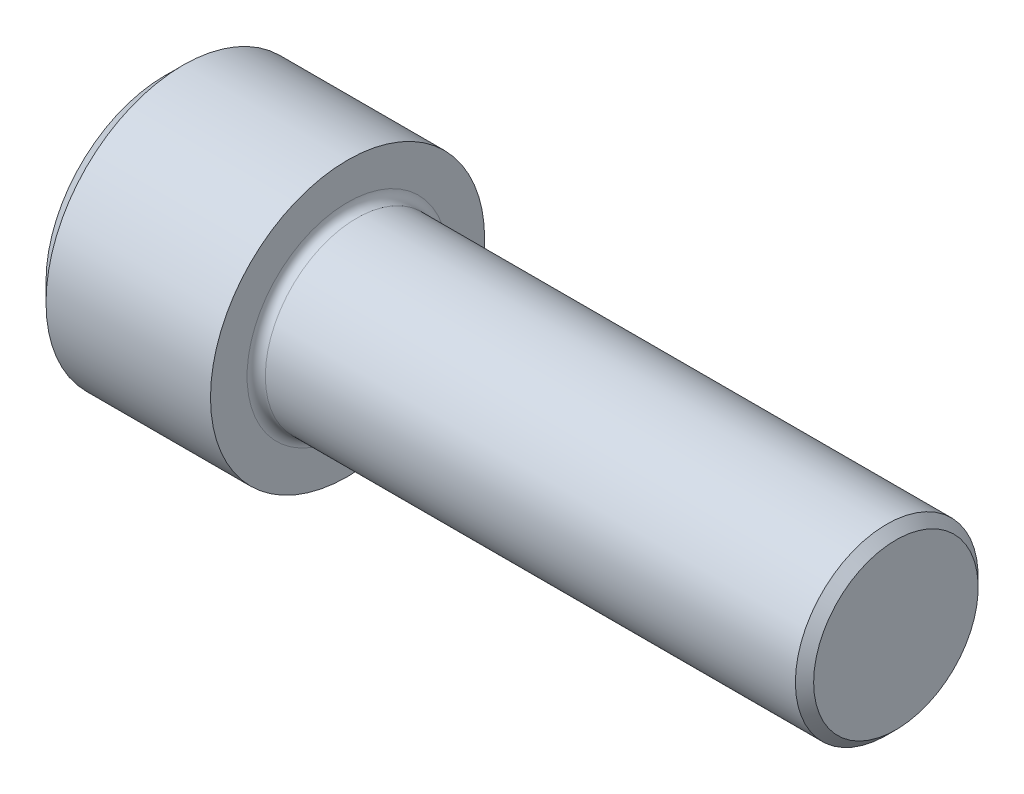
ISO-10303-21;
HEADER;
FILE_DESCRIPTION(('STEP AP214'),'2;1');
FILE_NAME('part.step','',(''),(''),'','','');
FILE_SCHEMA(('AUTOMOTIVE_DESIGN { 1 0 10303 214 1 1 1 1 }'));
ENDSEC;
DATA;
#1=APPLICATION_CONTEXT('core data for automotive mechanical design processes');
#2=APPLICATION_PROTOCOL_DEFINITION('international standard','automotive_design',2000,#1);
#3=PRODUCT_CONTEXT('',#1,'mechanical');
#4=PRODUCT('Part','Part','',(#3));
#5=PRODUCT_RELATED_PRODUCT_CATEGORY('part','',(#4));
#6=PRODUCT_DEFINITION_FORMATION('','',#4);
#7=PRODUCT_DEFINITION_CONTEXT('part definition',#1,'design');
#8=PRODUCT_DEFINITION('design','',#6,#7);
#9=PRODUCT_DEFINITION_SHAPE('','',#8);
#10=(LENGTH_UNIT() NAMED_UNIT(*) SI_UNIT(.MILLI.,.METRE.));
#11=(NAMED_UNIT(*) PLANE_ANGLE_UNIT() SI_UNIT($,.RADIAN.));
#12=(NAMED_UNIT(*) SI_UNIT($,.STERADIAN.) SOLID_ANGLE_UNIT());
#13=UNCERTAINTY_MEASURE_WITH_UNIT(LENGTH_MEASURE(1.E-05),#10,'distance_accuracy_value','');
#14=(GEOMETRIC_REPRESENTATION_CONTEXT(3) GLOBAL_UNCERTAINTY_ASSIGNED_CONTEXT((#13)) GLOBAL_UNIT_ASSIGNED_CONTEXT((#10,
#11,#12)) REPRESENTATION_CONTEXT('',''));
#15=CARTESIAN_POINT('',(0.,0.,0.));
#16=DIRECTION('',(0.,0.,1.));
#17=DIRECTION('',(1.,0.,0.));
#18=AXIS2_PLACEMENT_3D('',#15,#16,#17);
#19=CARTESIAN_POINT('',(0.,0.,0.));
#20=DIRECTION('',(-1.,0.,0.));
#21=DIRECTION('',(0.,0.,1.));
#22=AXIS2_PLACEMENT_3D('',#19,#20,#21);
#23=PLANE('',#22);
#24=DIRECTION('',(0.,-0.499999999999999,0.866025403784439));
#25=VECTOR('',#24,1.);
#26=CARTESIAN_POINT('',(0.,10.9985226280624,0.));
#27=LINE('',#26,#25);
#28=CARTESIAN_POINT('',(0.,10.9985226280624,0.));
#29=VERTEX_POINT('',#28);
#30=CARTESIAN_POINT('',(0.,5.4992613140312,9.52499999999999));
#31=VERTEX_POINT('',#30);
#32=EDGE_CURVE('E257',#29,#31,#27,.T.);
#33=ORIENTED_EDGE('',*,*,#32,.T.);
#34=DIRECTION('',(0.,1.,0.));
#35=VECTOR('',#34,1.);
#36=CARTESIAN_POINT('',(0.,-5.49926131403117,9.52500000000001));
#37=LINE('',#36,#35);
#38=CARTESIAN_POINT('',(0.,-5.49926131403117,9.52500000000001));
#39=VERTEX_POINT('',#38);
#40=EDGE_CURVE('E128',#39,#31,#37,.T.);
#41=ORIENTED_EDGE('',*,*,#40,.F.);
#42=DIRECTION('',(0.,-0.500000000000001,-0.866025403784438));
#43=VECTOR('',#42,1.);
#44=CARTESIAN_POINT('',(0.,-5.49926131403117,9.52500000000001));
#45=LINE('',#44,#43);
#46=CARTESIAN_POINT('',(0.,-10.9985226280624,0.));
#47=VERTEX_POINT('',#46);
#48=EDGE_CURVE('E260',#39,#47,#45,.T.);
#49=ORIENTED_EDGE('',*,*,#48,.T.);
#50=DIRECTION('',(0.,0.499999999999998,-0.86602540378444));
#51=VECTOR('',#50,1.);
#52=CARTESIAN_POINT('',(0.,-10.9985226280624,0.));
#53=LINE('',#52,#51);
#54=CARTESIAN_POINT('',(0.,-5.4992613140312,-9.525));
#55=VERTEX_POINT('',#54);
#56=EDGE_CURVE('E263',#47,#55,#53,.T.);
#57=ORIENTED_EDGE('',*,*,#56,.T.);
#58=DIRECTION('',(0.,-1.,0.));
#59=VECTOR('',#58,1.);
#60=CARTESIAN_POINT('',(0.,5.49926131403117,-9.52500000000001));
#61=LINE('',#60,#59);
#62=CARTESIAN_POINT('',(0.,5.49926131403117,-9.52500000000001));
#63=VERTEX_POINT('',#62);
#64=EDGE_CURVE('E266',#63,#55,#61,.T.);
#65=ORIENTED_EDGE('',*,*,#64,.F.);
#66=DIRECTION('',(0.,-0.500000000000001,-0.866025403784438));
#67=VECTOR('',#66,1.);
#68=CARTESIAN_POINT('',(0.,10.9985226280624,0.));
#69=LINE('',#68,#67);
#70=EDGE_CURVE('E123',#29,#63,#69,.T.);
#71=ORIENTED_EDGE('',*,*,#70,.F.);
#72=EDGE_LOOP('',(#33,#41,#49,#57,#65,#71));
#73=FACE_BOUND('',#72,.T.);
#74=CARTESIAN_POINT('',(0.,0.,0.));
#75=DIRECTION('',(-1.,0.,0.));
#76=DIRECTION('',(0.,0.,1.));
#77=AXIS2_PLACEMENT_3D('',#74,#75,#76);
#78=CIRCLE('',#77,16.51);
#79=CARTESIAN_POINT('',(0.,0.,16.51));
#80=VERTEX_POINT('',#79);
#81=EDGE_CURVE('E152',#80,#80,#78,.T.);
#82=ORIENTED_EDGE('',*,*,#81,.T.);
#83=EDGE_LOOP('',(#82));
#84=FACE_BOUND('',#83,.T.);
#85=ADVANCED_FACE('F32',(#73,#84),#23,.T.);
#86=CARTESIAN_POINT('',(0.,0.,0.));
#87=DIRECTION('',(1.,0.,0.));
#88=DIRECTION('',(0.,0.,-1.));
#89=AXIS2_PLACEMENT_3D('',#86,#87,#88);
#90=CONICAL_SURFACE('',#89,16.51,0.785398163397448);
#91=CARTESIAN_POINT('',(2.53999999999996,0.,0.));
#92=DIRECTION('',(-1.,0.,0.));
#93=DIRECTION('',(0.,0.,1.));
#94=AXIS2_PLACEMENT_3D('',#91,#92,#93);
#95=CIRCLE('',#94,19.05);
#96=CARTESIAN_POINT('',(2.53999999999996,0.,19.05));
#97=VERTEX_POINT('',#96);
#98=EDGE_CURVE('E149',#97,#97,#95,.T.);
#99=ORIENTED_EDGE('',*,*,#98,.T.);
#100=EDGE_LOOP('',(#99));
#101=FACE_BOUND('',#100,.T.);
#102=ORIENTED_EDGE('',*,*,#81,.F.);
#103=EDGE_LOOP('',(#102));
#104=FACE_BOUND('',#103,.T.);
#105=ADVANCED_FACE('F173',(#101,#104),#90,.T.);
#106=CARTESIAN_POINT('',(-31.75,0.,0.));
#107=DIRECTION('',(-1.,0.,0.));
#108=DIRECTION('',(0.,0.,1.));
#109=AXIS2_PLACEMENT_3D('',#106,#107,#108);
#110=CYLINDRICAL_SURFACE('',#109,19.05);
#111=CARTESIAN_POINT('',(25.4,0.,0.));
#112=DIRECTION('',(-1.,0.,0.));
#113=DIRECTION('',(0.,0.,1.));
#114=AXIS2_PLACEMENT_3D('',#111,#112,#113);
#115=CIRCLE('',#114,19.05);
#116=CARTESIAN_POINT('',(25.4,0.,19.05));
#117=VERTEX_POINT('',#116);
#118=EDGE_CURVE('E146',#117,#117,#115,.T.);
#119=ORIENTED_EDGE('',*,*,#118,.T.);
#120=EDGE_LOOP('',(#119));
#121=FACE_BOUND('',#120,.T.);
#122=ORIENTED_EDGE('',*,*,#98,.F.);
#123=EDGE_LOOP('',(#122));
#124=FACE_BOUND('',#123,.T.);
#125=ADVANCED_FACE('F178',(#121,#124),#110,.T.);
#126=CARTESIAN_POINT('',(25.4,19.05,0.));
#127=DIRECTION('',(1.,0.,0.));
#128=DIRECTION('',(0.,0.,-1.));
#129=AXIS2_PLACEMENT_3D('',#126,#127,#128);
#130=PLANE('',#129);
#131=CARTESIAN_POINT('',(25.4,0.,0.));
#132=DIRECTION('',(1.,0.,0.));
#133=DIRECTION('',(0.,0.,-1.));
#134=AXIS2_PLACEMENT_3D('',#131,#132,#133);
#135=CIRCLE('',#134,13.97);
#136=CARTESIAN_POINT('',(25.4,0.,-13.97));
#137=VERTEX_POINT('',#136);
#138=EDGE_CURVE('E40',#137,#137,#135,.F.);
#139=ORIENTED_EDGE('',*,*,#138,.T.);
#140=EDGE_LOOP('',(#139));
#141=FACE_BOUND('',#140,.T.);
#142=ORIENTED_EDGE('',*,*,#118,.F.);
#143=EDGE_LOOP('',(#142));
#144=FACE_BOUND('',#143,.T.);
#145=ADVANCED_FACE('F157',(#141,#144),#130,.T.);
#146=CARTESIAN_POINT('',(-31.75,0.,0.));
#147=DIRECTION('',(-1.,0.,0.));
#148=DIRECTION('',(0.,0.,1.));
#149=AXIS2_PLACEMENT_3D('',#146,#147,#148);
#150=CYLINDRICAL_SURFACE('',#149,12.7);
#151=CARTESIAN_POINT('',(26.67,0.,0.));
#152=DIRECTION('',(1.,0.,0.));
#153=DIRECTION('',(0.,0.,-1.));
#154=AXIS2_PLACEMENT_3D('',#151,#152,#153);
#155=CIRCLE('',#154,12.7);
#156=CARTESIAN_POINT('',(26.67,0.,-12.7));
#157=VERTEX_POINT('',#156);
#158=EDGE_CURVE('E11',#157,#157,#155,.T.);
#159=ORIENTED_EDGE('',*,*,#158,.T.);
#160=EDGE_LOOP('',(#159));
#161=FACE_BOUND('',#160,.T.);
#162=CARTESIAN_POINT('',(100.33127,0.,0.));
#163=DIRECTION('',(-1.,0.,0.));
#164=DIRECTION('',(0.,0.,1.));
#165=AXIS2_PLACEMENT_3D('',#162,#163,#164);
#166=CIRCLE('',#165,12.7);
#167=CARTESIAN_POINT('',(100.33127,0.,12.7));
#168=VERTEX_POINT('',#167);
#169=EDGE_CURVE('E143',#168,#168,#166,.T.);
#170=ORIENTED_EDGE('',*,*,#169,.T.);
#171=EDGE_LOOP('',(#170));
#172=FACE_BOUND('',#171,.T.);
#173=ADVANCED_FACE('F188',(#161,#172),#150,.T.);
#174=CARTESIAN_POINT('',(101.6,0.,0.));
#175=DIRECTION('',(-1.,0.,0.));
#176=DIRECTION('',(0.,0.,1.));
#177=AXIS2_PLACEMENT_3D('',#174,#175,#176);
#178=CONICAL_SURFACE('',#177,11.43127,0.785398163397472);
#179=ORIENTED_EDGE('',*,*,#169,.F.);
#180=EDGE_LOOP('',(#179));
#181=FACE_BOUND('',#180,.T.);
#182=CARTESIAN_POINT('',(101.6,0.,0.));
#183=DIRECTION('',(-1.,0.,0.));
#184=DIRECTION('',(0.,0.,1.));
#185=AXIS2_PLACEMENT_3D('',#182,#183,#184);
#186=CIRCLE('',#185,11.43127);
#187=CARTESIAN_POINT('',(101.6,0.,11.43127));
#188=VERTEX_POINT('',#187);
#189=EDGE_CURVE('E139',#188,#188,#186,.T.);
#190=ORIENTED_EDGE('',*,*,#189,.T.);
#191=EDGE_LOOP('',(#190));
#192=FACE_BOUND('',#191,.T.);
#193=ADVANCED_FACE('F168',(#181,#192),#178,.T.);
#194=CARTESIAN_POINT('',(101.6,11.43127,0.));
#195=DIRECTION('',(1.,0.,0.));
#196=DIRECTION('',(0.,0.,-1.));
#197=AXIS2_PLACEMENT_3D('',#194,#195,#196);
#198=PLANE('',#197);
#199=ORIENTED_EDGE('',*,*,#189,.F.);
#200=EDGE_LOOP('',(#199));
#201=FACE_BOUND('',#200,.T.);
#202=ADVANCED_FACE('F161',(#201),#198,.T.);
#203=CARTESIAN_POINT('',(26.67,0.,0.));
#204=DIRECTION('',(1.,0.,0.));
#205=DIRECTION('',(0.,0.,-1.));
#206=AXIS2_PLACEMENT_3D('',#203,#204,#205);
#207=TOROIDAL_SURFACE('',#206,13.97,1.27);
#208=ORIENTED_EDGE('',*,*,#158,.F.);
#209=EDGE_LOOP('',(#208));
#210=FACE_BOUND('',#209,.T.);
#211=ORIENTED_EDGE('',*,*,#138,.F.);
#212=EDGE_LOOP('',(#211));
#213=FACE_BOUND('',#212,.T.);
#214=ADVANCED_FACE('F34',(#210,#213),#207,.F.);
#215=CARTESIAN_POINT('',(12.573,10.9985226280624,0.));
#216=DIRECTION('',(0.,-0.86602540378444,-0.499999999999999));
#217=DIRECTION('',(0.,0.499999999999999,-0.866025403784439));
#218=AXIS2_PLACEMENT_3D('',#215,#216,#217);
#219=PLANE('',#218);
#220=ORIENTED_EDGE('',*,*,#32,.F.);
#221=DIRECTION('',(-1.,0.,0.));
#222=VECTOR('',#221,1.);
#223=CARTESIAN_POINT('',(12.573,10.9985226280624,0.));
#224=LINE('',#223,#222);
#225=CARTESIAN_POINT('',(12.573,10.9985226280624,0.));
#226=VERTEX_POINT('',#225);
#227=EDGE_CURVE('E247',#226,#29,#224,.T.);
#228=ORIENTED_EDGE('',*,*,#227,.F.);
#229=DIRECTION('',(0.,-0.499999999999999,0.866025403784439));
#230=VECTOR('',#229,1.);
#231=CARTESIAN_POINT('',(12.573,10.9985226280624,0.));
#232=LINE('',#231,#230);
#233=CARTESIAN_POINT('',(12.573,8.24889197104679,4.76249999999999));
#234=VERTEX_POINT('',#233);
#235=EDGE_CURVE('E115',#226,#234,#232,.T.);
#236=ORIENTED_EDGE('',*,*,#235,.T.);
#237=CARTESIAN_POINT('',(12.573,5.4992613140312,9.52499999999999));
#238=VERTEX_POINT('',#237);
#239=EDGE_CURVE('E106',#234,#238,#232,.T.);
#240=ORIENTED_EDGE('',*,*,#239,.T.);
#241=DIRECTION('',(-1.,0.,0.));
#242=VECTOR('',#241,1.);
#243=CARTESIAN_POINT('',(12.573,5.4992613140312,9.52499999999999));
#244=LINE('',#243,#242);
#245=EDGE_CURVE('E120',#238,#31,#244,.T.);
#246=ORIENTED_EDGE('',*,*,#245,.T.);
#247=EDGE_LOOP('',(#220,#228,#236,#240,#246));
#248=FACE_BOUND('',#247,.T.);
#249=ADVANCED_FACE('F119',(#248),#219,.T.);
#250=CARTESIAN_POINT('',(12.573,-5.49926131403117,9.52500000000001));
#251=DIRECTION('',(0.,0.,1.));
#252=DIRECTION('',(0.,-1.,0.));
#253=AXIS2_PLACEMENT_3D('',#250,#251,#252);
#254=PLANE('',#253);
#255=ORIENTED_EDGE('',*,*,#40,.T.);
#256=ORIENTED_EDGE('',*,*,#245,.F.);
#257=DIRECTION('',(0.,1.,0.));
#258=VECTOR('',#257,1.);
#259=CARTESIAN_POINT('',(12.573,-5.49926131403117,9.52500000000001));
#260=LINE('',#259,#258);
#261=CARTESIAN_POINT('',(12.573,0.,9.525));
#262=VERTEX_POINT('',#261);
#263=EDGE_CURVE('E103',#262,#238,#260,.T.);
#264=ORIENTED_EDGE('',*,*,#263,.F.);
#265=CARTESIAN_POINT('',(12.573,-5.49926131403117,9.52500000000001));
#266=VERTEX_POINT('',#265);
#267=EDGE_CURVE('E114',#266,#262,#260,.T.);
#268=ORIENTED_EDGE('',*,*,#267,.F.);
#269=DIRECTION('',(-1.,0.,0.));
#270=VECTOR('',#269,1.);
#271=CARTESIAN_POINT('',(12.573,-5.49926131403117,9.52500000000001));
#272=LINE('',#271,#270);
#273=EDGE_CURVE('E130',#266,#39,#272,.T.);
#274=ORIENTED_EDGE('',*,*,#273,.T.);
#275=EDGE_LOOP('',(#255,#256,#264,#268,#274));
#276=FACE_BOUND('',#275,.T.);
#277=ADVANCED_FACE('F125',(#276),#254,.F.);
#278=CARTESIAN_POINT('',(12.573,-5.49926131403117,9.52500000000001));
#279=DIRECTION('',(0.,0.866025403784438,-0.500000000000001));
#280=DIRECTION('',(0.,0.500000000000001,0.866025403784438));
#281=AXIS2_PLACEMENT_3D('',#278,#279,#280);
#282=PLANE('',#281);
#283=ORIENTED_EDGE('',*,*,#48,.F.);
#284=ORIENTED_EDGE('',*,*,#273,.F.);
#285=DIRECTION('',(0.,-0.500000000000001,-0.866025403784438));
#286=VECTOR('',#285,1.);
#287=CARTESIAN_POINT('',(12.573,-5.49926131403117,9.52500000000001));
#288=LINE('',#287,#286);
#289=CARTESIAN_POINT('',(12.573,-8.24889197104677,4.76250000000001));
#290=VERTEX_POINT('',#289);
#291=EDGE_CURVE('E286',#266,#290,#288,.T.);
#292=ORIENTED_EDGE('',*,*,#291,.T.);
#293=CARTESIAN_POINT('',(12.573,-10.9985226280624,0.));
#294=VERTEX_POINT('',#293);
#295=EDGE_CURVE('E275',#290,#294,#288,.T.);
#296=ORIENTED_EDGE('',*,*,#295,.T.);
#297=DIRECTION('',(-1.,0.,0.));
#298=VECTOR('',#297,1.);
#299=CARTESIAN_POINT('',(12.573,-10.9985226280624,0.));
#300=LINE('',#299,#298);
#301=EDGE_CURVE('E135',#294,#47,#300,.T.);
#302=ORIENTED_EDGE('',*,*,#301,.T.);
#303=EDGE_LOOP('',(#283,#284,#292,#296,#302));
#304=FACE_BOUND('',#303,.T.);
#305=ADVANCED_FACE('F201',(#304),#282,.T.);
#306=CARTESIAN_POINT('',(12.573,-10.9985226280624,0.));
#307=DIRECTION('',(0.,0.86602540378444,0.499999999999998));
#308=DIRECTION('',(0.,-0.499999999999998,0.86602540378444));
#309=AXIS2_PLACEMENT_3D('',#306,#307,#308);
#310=PLANE('',#309);
#311=ORIENTED_EDGE('',*,*,#56,.F.);
#312=ORIENTED_EDGE('',*,*,#301,.F.);
#313=DIRECTION('',(0.,0.499999999999998,-0.86602540378444));
#314=VECTOR('',#313,1.);
#315=CARTESIAN_POINT('',(12.573,-10.9985226280624,0.));
#316=LINE('',#315,#314);
#317=CARTESIAN_POINT('',(12.573,-8.24889197104679,-4.76249999999998));
#318=VERTEX_POINT('',#317);
#319=EDGE_CURVE('E253',#294,#318,#316,.T.);
#320=ORIENTED_EDGE('',*,*,#319,.T.);
#321=CARTESIAN_POINT('',(12.573,-5.4992613140312,-9.525));
#322=VERTEX_POINT('',#321);
#323=EDGE_CURVE('E285',#318,#322,#316,.T.);
#324=ORIENTED_EDGE('',*,*,#323,.T.);
#325=DIRECTION('',(-1.,0.,0.));
#326=VECTOR('',#325,1.);
#327=CARTESIAN_POINT('',(12.573,-5.4992613140312,-9.525));
#328=LINE('',#327,#326);
#329=EDGE_CURVE('E246',#322,#55,#328,.T.);
#330=ORIENTED_EDGE('',*,*,#329,.T.);
#331=EDGE_LOOP('',(#311,#312,#320,#324,#330));
#332=FACE_BOUND('',#331,.T.);
#333=ADVANCED_FACE('F204',(#332),#310,.T.);
#334=CARTESIAN_POINT('',(12.573,5.49926131403117,-9.52500000000001));
#335=DIRECTION('',(0.,0.,-1.));
#336=DIRECTION('',(0.,1.,0.));
#337=AXIS2_PLACEMENT_3D('',#334,#335,#336);
#338=PLANE('',#337);
#339=ORIENTED_EDGE('',*,*,#64,.T.);
#340=ORIENTED_EDGE('',*,*,#329,.F.);
#341=DIRECTION('',(0.,-1.,0.));
#342=VECTOR('',#341,1.);
#343=CARTESIAN_POINT('',(12.573,5.49926131403117,-9.52500000000001));
#344=LINE('',#343,#342);
#345=CARTESIAN_POINT('',(12.573,0.,-9.525));
#346=VERTEX_POINT('',#345);
#347=EDGE_CURVE('E250',#346,#322,#344,.T.);
#348=ORIENTED_EDGE('',*,*,#347,.F.);
#349=CARTESIAN_POINT('',(12.573,5.49926131403117,-9.52500000000001));
#350=VERTEX_POINT('',#349);
#351=EDGE_CURVE('E47',#350,#346,#344,.T.);
#352=ORIENTED_EDGE('',*,*,#351,.F.);
#353=DIRECTION('',(-1.,0.,0.));
#354=VECTOR('',#353,1.);
#355=CARTESIAN_POINT('',(12.573,5.49926131403117,-9.52500000000001));
#356=LINE('',#355,#354);
#357=EDGE_CURVE('E243',#350,#63,#356,.T.);
#358=ORIENTED_EDGE('',*,*,#357,.T.);
#359=EDGE_LOOP('',(#339,#340,#348,#352,#358));
#360=FACE_BOUND('',#359,.T.);
#361=ADVANCED_FACE('F208',(#360),#338,.F.);
#362=CARTESIAN_POINT('',(12.573,10.9985226280624,0.));
#363=DIRECTION('',(0.,0.866025403784438,-0.500000000000001));
#364=DIRECTION('',(0.,0.500000000000001,0.866025403784438));
#365=AXIS2_PLACEMENT_3D('',#362,#363,#364);
#366=PLANE('',#365);
#367=ORIENTED_EDGE('',*,*,#70,.T.);
#368=ORIENTED_EDGE('',*,*,#357,.F.);
#369=DIRECTION('',(0.,-0.500000000000001,-0.866025403784438));
#370=VECTOR('',#369,1.);
#371=CARTESIAN_POINT('',(12.573,10.9985226280624,0.));
#372=LINE('',#371,#370);
#373=CARTESIAN_POINT('',(12.573,8.24889197104678,-4.76250000000002));
#374=VERTEX_POINT('',#373);
#375=EDGE_CURVE('E233',#374,#350,#372,.T.);
#376=ORIENTED_EDGE('',*,*,#375,.F.);
#377=EDGE_CURVE('E239',#226,#374,#372,.T.);
#378=ORIENTED_EDGE('',*,*,#377,.F.);
#379=ORIENTED_EDGE('',*,*,#227,.T.);
#380=EDGE_LOOP('',(#367,#368,#376,#378,#379));
#381=FACE_BOUND('',#380,.T.);
#382=ADVANCED_FACE('F212',(#381),#366,.F.);
#383=CARTESIAN_POINT('',(12.573,16.4977839420935,-9.52500000000002));
#384=DIRECTION('',(1.,0.,0.));
#385=DIRECTION('',(0.,0.,-1.));
#386=AXIS2_PLACEMENT_3D('',#383,#384,#385);
#387=PLANE('',#386);
#388=ORIENTED_EDGE('',*,*,#347,.T.);
#389=ORIENTED_EDGE('',*,*,#323,.F.);
#390=CARTESIAN_POINT('',(12.573,0.,0.));
#391=DIRECTION('',(-1.,0.,0.));
#392=DIRECTION('',(0.,0.,1.));
#393=AXIS2_PLACEMENT_3D('',#390,#391,#392);
#394=CIRCLE('',#393,9.525);
#395=EDGE_CURVE('E281',#346,#318,#394,.T.);
#396=ORIENTED_EDGE('',*,*,#395,.F.);
#397=EDGE_LOOP('',(#388,#389,#396));
#398=FACE_BOUND('',#397,.T.);
#399=ADVANCED_FACE('F216',(#398),#387,.F.);
#400=ORIENTED_EDGE('',*,*,#319,.F.);
#401=ORIENTED_EDGE('',*,*,#295,.F.);
#402=EDGE_CURVE('E133',#318,#290,#394,.T.);
#403=ORIENTED_EDGE('',*,*,#402,.F.);
#404=EDGE_LOOP('',(#400,#401,#403));
#405=FACE_BOUND('',#404,.T.);
#406=ADVANCED_FACE('F219',(#405),#387,.F.);
#407=ORIENTED_EDGE('',*,*,#291,.F.);
#408=ORIENTED_EDGE('',*,*,#267,.T.);
#409=EDGE_CURVE('E129',#290,#262,#394,.T.);
#410=ORIENTED_EDGE('',*,*,#409,.F.);
#411=EDGE_LOOP('',(#407,#408,#410));
#412=FACE_BOUND('',#411,.T.);
#413=ADVANCED_FACE('F224',(#412),#387,.F.);
#414=ORIENTED_EDGE('',*,*,#263,.T.);
#415=ORIENTED_EDGE('',*,*,#239,.F.);
#416=EDGE_CURVE('E109',#262,#234,#394,.T.);
#417=ORIENTED_EDGE('',*,*,#416,.F.);
#418=EDGE_LOOP('',(#414,#415,#417));
#419=FACE_BOUND('',#418,.T.);
#420=ADVANCED_FACE('F105',(#419),#387,.F.);
#421=ORIENTED_EDGE('',*,*,#235,.F.);
#422=ORIENTED_EDGE('',*,*,#377,.T.);
#423=EDGE_CURVE('E140',#234,#374,#394,.T.);
#424=ORIENTED_EDGE('',*,*,#423,.F.);
#425=EDGE_LOOP('',(#421,#422,#424));
#426=FACE_BOUND('',#425,.T.);
#427=ADVANCED_FACE('F227',(#426),#387,.F.);
#428=ORIENTED_EDGE('',*,*,#375,.T.);
#429=ORIENTED_EDGE('',*,*,#351,.T.);
#430=EDGE_CURVE('E236',#374,#346,#394,.T.);
#431=ORIENTED_EDGE('',*,*,#430,.F.);
#432=EDGE_LOOP('',(#428,#429,#431));
#433=FACE_BOUND('',#432,.T.);
#434=ADVANCED_FACE('F197',(#433),#387,.F.);
#435=CARTESIAN_POINT('',(12.573,0.,0.));
#436=DIRECTION('',(-1.,0.,0.));
#437=DIRECTION('',(0.,0.,1.));
#438=AXIS2_PLACEMENT_3D('',#435,#436,#437);
#439=CONICAL_SURFACE('',#438,9.525,1.04719755119659);
#440=CARTESIAN_POINT('',(18.0722613140313,0.,0.));
#441=VERTEX_POINT('',#440);
#442=VERTEX_LOOP('',#441);
#443=FACE_BOUND('',#442,.T.);
#444=ORIENTED_EDGE('',*,*,#416,.T.);
#445=ORIENTED_EDGE('',*,*,#423,.T.);
#446=ORIENTED_EDGE('',*,*,#430,.T.);
#447=ORIENTED_EDGE('',*,*,#395,.T.);
#448=ORIENTED_EDGE('',*,*,#402,.T.);
#449=ORIENTED_EDGE('',*,*,#409,.T.);
#450=EDGE_LOOP('',(#444,#445,#446,#447,#448,#449));
#451=FACE_BOUND('',#450,.T.);
#452=ADVANCED_FACE('F195',(#443,#451),#439,.F.);
#453=CLOSED_SHELL('',(#85,#105,#125,#145,#173,#193,#202,#214,#249,#277,#305,#333,#361,#382,#399,
#406,#413,#420,#427,#434,#452));
#454=MANIFOLD_SOLID_BREP('B2',#453);
#455=ADVANCED_BREP_SHAPE_REPRESENTATION('',(#18,#454),#14);
#456=SHAPE_DEFINITION_REPRESENTATION(#9,#455);
ENDSEC;
END-ISO-10303-21;
